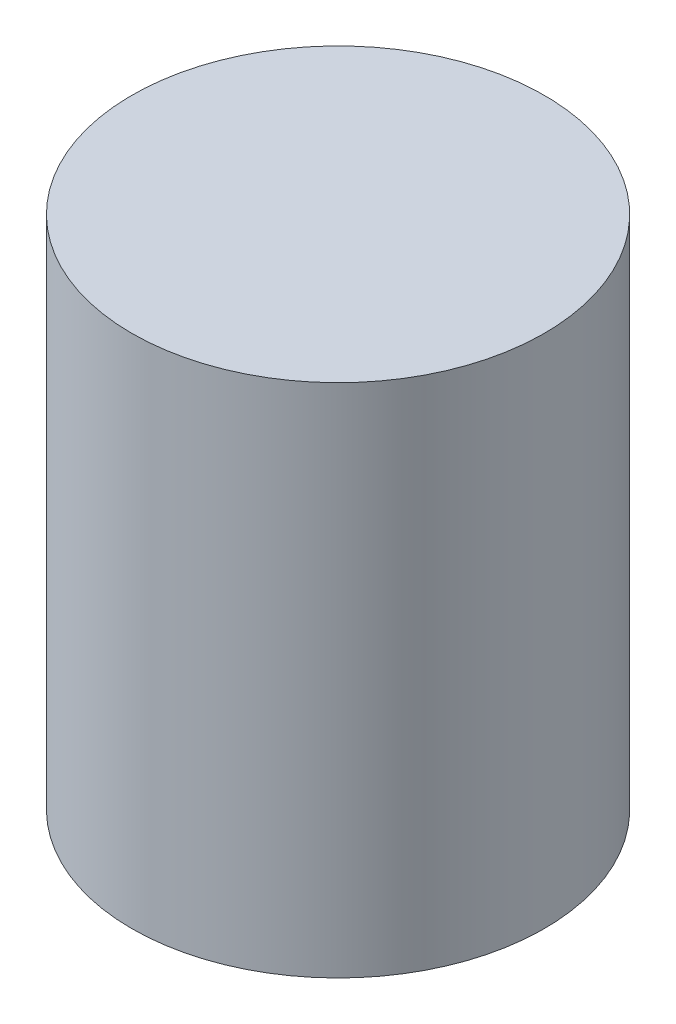
ISO-10303-21;
HEADER;
FILE_DESCRIPTION(('STEP AP214'),'2;1');
FILE_NAME('part.step','',(''),(''),'','','');
FILE_SCHEMA(('AUTOMOTIVE_DESIGN { 1 0 10303 214 1 1 1 1 }'));
ENDSEC;
DATA;
#1=APPLICATION_CONTEXT('core data for automotive mechanical design processes');
#2=APPLICATION_PROTOCOL_DEFINITION('international standard','automotive_design',2000,#1);
#3=PRODUCT_CONTEXT('',#1,'mechanical');
#4=PRODUCT('Part','Part','',(#3));
#5=PRODUCT_RELATED_PRODUCT_CATEGORY('part','',(#4));
#6=PRODUCT_DEFINITION_FORMATION('','',#4);
#7=PRODUCT_DEFINITION_CONTEXT('part definition',#1,'design');
#8=PRODUCT_DEFINITION('design','',#6,#7);
#9=PRODUCT_DEFINITION_SHAPE('','',#8);
#10=(LENGTH_UNIT() NAMED_UNIT(*) SI_UNIT(.MILLI.,.METRE.));
#11=(NAMED_UNIT(*) PLANE_ANGLE_UNIT() SI_UNIT($,.RADIAN.));
#12=(NAMED_UNIT(*) SI_UNIT($,.STERADIAN.) SOLID_ANGLE_UNIT());
#13=UNCERTAINTY_MEASURE_WITH_UNIT(LENGTH_MEASURE(1.E-05),#10,'distance_accuracy_value','');
#14=(GEOMETRIC_REPRESENTATION_CONTEXT(3) GLOBAL_UNCERTAINTY_ASSIGNED_CONTEXT((#13)) GLOBAL_UNIT_ASSIGNED_CONTEXT((#10,
#11,#12)) REPRESENTATION_CONTEXT('',''));
#15=CARTESIAN_POINT('',(0.,0.,0.));
#16=DIRECTION('',(0.,0.,1.));
#17=DIRECTION('',(1.,0.,0.));
#18=AXIS2_PLACEMENT_3D('',#15,#16,#17);
#19=CARTESIAN_POINT('',(0.,5.,0.));
#20=DIRECTION('',(0.,-1.,0.));
#21=DIRECTION('',(0.,0.,-1.));
#22=AXIS2_PLACEMENT_3D('',#19,#20,#21);
#23=CYLINDRICAL_SURFACE('',#22,2.);
#24=CARTESIAN_POINT('',(0.,5.,0.));
#25=DIRECTION('',(0.,1.,0.));
#26=DIRECTION('',(0.,0.,1.));
#27=AXIS2_PLACEMENT_3D('',#24,#25,#26);
#28=CIRCLE('',#27,2.);
#29=CARTESIAN_POINT('',(0.,5.,2.));
#30=VERTEX_POINT('',#29);
#31=EDGE_CURVE('E10',#30,#30,#28,.T.);
#32=ORIENTED_EDGE('',*,*,#31,.F.);
#33=EDGE_LOOP('',(#32));
#34=FACE_BOUND('',#33,.T.);
#35=CARTESIAN_POINT('',(0.,0.,0.));
#36=DIRECTION('',(0.,1.,0.));
#37=DIRECTION('',(0.,0.,1.));
#38=AXIS2_PLACEMENT_3D('',#35,#36,#37);
#39=CIRCLE('',#38,2.);
#40=CARTESIAN_POINT('',(0.,0.,2.));
#41=VERTEX_POINT('',#40);
#42=EDGE_CURVE('E40',#41,#41,#39,.T.);
#43=ORIENTED_EDGE('',*,*,#42,.T.);
#44=EDGE_LOOP('',(#43));
#45=FACE_BOUND('',#44,.T.);
#46=ADVANCED_FACE('F37',(#34,#45),#23,.T.);
#47=CARTESIAN_POINT('',(0.,5.,0.));
#48=DIRECTION('',(0.,1.,0.));
#49=DIRECTION('',(0.,0.,1.));
#50=AXIS2_PLACEMENT_3D('',#47,#48,#49);
#51=PLANE('',#50);
#52=ORIENTED_EDGE('',*,*,#31,.T.);
#53=EDGE_LOOP('',(#52));
#54=FACE_BOUND('',#53,.T.);
#55=ADVANCED_FACE('F54',(#54),#51,.T.);
#56=CARTESIAN_POINT('',(0.,0.,0.));
#57=DIRECTION('',(0.,1.,0.));
#58=DIRECTION('',(0.,0.,1.));
#59=AXIS2_PLACEMENT_3D('',#56,#57,#58);
#60=PLANE('',#59);
#61=ORIENTED_EDGE('',*,*,#42,.F.);
#62=EDGE_LOOP('',(#61));
#63=FACE_BOUND('',#62,.T.);
#64=ADVANCED_FACE('F52',(#63),#60,.F.);
#65=CLOSED_SHELL('',(#46,#55,#64));
#66=MANIFOLD_SOLID_BREP('B2',#65);
#67=ADVANCED_BREP_SHAPE_REPRESENTATION('',(#18,#66),#14);
#68=SHAPE_DEFINITION_REPRESENTATION(#9,#67);
ENDSEC;
END-ISO-10303-21;
